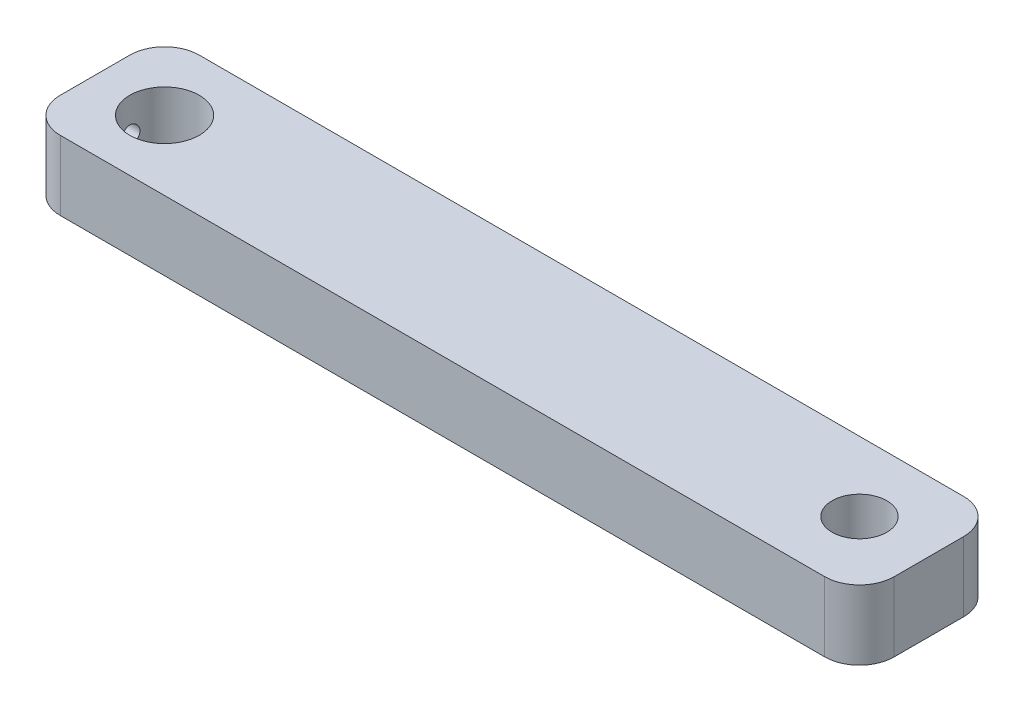
ISO-10303-21;
HEADER;
FILE_DESCRIPTION(('STEP AP214'),'2;1');
FILE_NAME('part.step','',(''),(''),'','','');
FILE_SCHEMA(('AUTOMOTIVE_DESIGN { 1 0 10303 214 1 1 1 1 }'));
ENDSEC;
DATA;
#1=APPLICATION_CONTEXT('core data for automotive mechanical design processes');
#2=APPLICATION_PROTOCOL_DEFINITION('international standard','automotive_design',2000,#1);
#3=PRODUCT_CONTEXT('',#1,'mechanical');
#4=PRODUCT('Part','Part','',(#3));
#5=PRODUCT_RELATED_PRODUCT_CATEGORY('part','',(#4));
#6=PRODUCT_DEFINITION_FORMATION('','',#4);
#7=PRODUCT_DEFINITION_CONTEXT('part definition',#1,'design');
#8=PRODUCT_DEFINITION('design','',#6,#7);
#9=PRODUCT_DEFINITION_SHAPE('','',#8);
#10=(LENGTH_UNIT() NAMED_UNIT(*) SI_UNIT(.MILLI.,.METRE.));
#11=(NAMED_UNIT(*) PLANE_ANGLE_UNIT() SI_UNIT($,.RADIAN.));
#12=(NAMED_UNIT(*) SI_UNIT($,.STERADIAN.) SOLID_ANGLE_UNIT());
#13=UNCERTAINTY_MEASURE_WITH_UNIT(LENGTH_MEASURE(1.E-05),#10,'distance_accuracy_value','');
#14=(GEOMETRIC_REPRESENTATION_CONTEXT(3) GLOBAL_UNCERTAINTY_ASSIGNED_CONTEXT((#13)) GLOBAL_UNIT_ASSIGNED_CONTEXT((#10,
#11,#12)) REPRESENTATION_CONTEXT('',''));
#15=CARTESIAN_POINT('',(0.,0.,0.));
#16=DIRECTION('',(0.,0.,1.));
#17=DIRECTION('',(1.,0.,0.));
#18=AXIS2_PLACEMENT_3D('',#15,#16,#17);
#19=CARTESIAN_POINT('',(0.,12.7,0.));
#20=DIRECTION('',(0.,1.,0.));
#21=DIRECTION('',(0.,0.,1.));
#22=AXIS2_PLACEMENT_3D('',#19,#20,#21);
#23=PLANE('',#22);
#24=CARTESIAN_POINT('',(0.,12.7,0.));
#25=DIRECTION('',(0.,1.,0.));
#26=DIRECTION('',(0.,0.,1.));
#27=AXIS2_PLACEMENT_3D('',#24,#25,#26);
#28=CIRCLE('',#27,6.35);
#29=CARTESIAN_POINT('',(0.,12.7,6.35));
#30=VERTEX_POINT('',#29);
#31=EDGE_CURVE('E214',#30,#30,#28,.T.);
#32=ORIENTED_EDGE('',*,*,#31,.F.);
#33=EDGE_LOOP('',(#32));
#34=FACE_BOUND('',#33,.T.);
#35=DIRECTION('',(1.,0.,0.));
#36=VECTOR('',#35,1.);
#37=CARTESIAN_POINT('',(-12.7,12.7,12.7));
#38=LINE('',#37,#36);
#39=CARTESIAN_POINT('',(-6.35,12.7,12.7));
#40=VERTEX_POINT('',#39);
#41=CARTESIAN_POINT('',(133.35,12.7,12.7));
#42=VERTEX_POINT('',#41);
#43=EDGE_CURVE('E225',#40,#42,#38,.T.);
#44=ORIENTED_EDGE('',*,*,#43,.T.);
#45=CARTESIAN_POINT('',(133.35,12.7,6.35));
#46=DIRECTION('',(0.,1.,0.));
#47=DIRECTION('',(0.,0.,1.));
#48=AXIS2_PLACEMENT_3D('',#45,#46,#47);
#49=CIRCLE('',#48,6.35);
#50=CARTESIAN_POINT('',(139.7,12.7,6.35));
#51=VERTEX_POINT('',#50);
#52=EDGE_CURVE('E193',#42,#51,#49,.T.);
#53=ORIENTED_EDGE('',*,*,#52,.T.);
#54=DIRECTION('',(0.,0.,-1.));
#55=VECTOR('',#54,1.);
#56=CARTESIAN_POINT('',(139.7,12.7,-12.7));
#57=LINE('',#56,#55);
#58=CARTESIAN_POINT('',(139.7,12.7,-6.35));
#59=VERTEX_POINT('',#58);
#60=EDGE_CURVE('E147',#51,#59,#57,.T.);
#61=ORIENTED_EDGE('',*,*,#60,.T.);
#62=CARTESIAN_POINT('',(133.35,12.7,-6.35));
#63=DIRECTION('',(0.,1.,0.));
#64=DIRECTION('',(0.,0.,1.));
#65=AXIS2_PLACEMENT_3D('',#62,#63,#64);
#66=CIRCLE('',#65,6.35);
#67=CARTESIAN_POINT('',(133.35,12.7,-12.7));
#68=VERTEX_POINT('',#67);
#69=EDGE_CURVE('E72',#59,#68,#66,.T.);
#70=ORIENTED_EDGE('',*,*,#69,.T.);
#71=DIRECTION('',(-1.,0.,0.));
#72=VECTOR('',#71,1.);
#73=CARTESIAN_POINT('',(-12.7,12.7,-12.7));
#74=LINE('',#73,#72);
#75=CARTESIAN_POINT('',(-6.35,12.7,-12.7));
#76=VERTEX_POINT('',#75);
#77=EDGE_CURVE('E171',#68,#76,#74,.T.);
#78=ORIENTED_EDGE('',*,*,#77,.T.);
#79=CARTESIAN_POINT('',(-6.35,12.7,-6.35));
#80=DIRECTION('',(0.,1.,0.));
#81=DIRECTION('',(0.,0.,1.));
#82=AXIS2_PLACEMENT_3D('',#79,#80,#81);
#83=CIRCLE('',#82,6.35);
#84=CARTESIAN_POINT('',(-12.7,12.7,-6.35));
#85=VERTEX_POINT('',#84);
#86=EDGE_CURVE('E185',#76,#85,#83,.T.);
#87=ORIENTED_EDGE('',*,*,#86,.T.);
#88=DIRECTION('',(0.,0.,1.));
#89=VECTOR('',#88,1.);
#90=CARTESIAN_POINT('',(-12.7,12.7,-12.7));
#91=LINE('',#90,#89);
#92=CARTESIAN_POINT('',(-12.7,12.7,6.35));
#93=VERTEX_POINT('',#92);
#94=EDGE_CURVE('E163',#85,#93,#91,.T.);
#95=ORIENTED_EDGE('',*,*,#94,.T.);
#96=CARTESIAN_POINT('',(-6.35,12.7,6.35));
#97=DIRECTION('',(0.,1.,0.));
#98=DIRECTION('',(0.,0.,1.));
#99=AXIS2_PLACEMENT_3D('',#96,#97,#98);
#100=CIRCLE('',#99,6.35);
#101=EDGE_CURVE('E188',#93,#40,#100,.T.);
#102=ORIENTED_EDGE('',*,*,#101,.T.);
#103=EDGE_LOOP('',(#44,#53,#61,#70,#78,#87,#95,#102));
#104=FACE_BOUND('',#103,.T.);
#105=CARTESIAN_POINT('',(127.,12.7,0.));
#106=DIRECTION('',(0.,1.,0.));
#107=DIRECTION('',(0.,0.,1.));
#108=AXIS2_PLACEMENT_3D('',#105,#106,#107);
#109=CIRCLE('',#108,4.99999999999999);
#110=CARTESIAN_POINT('',(127.,12.7,4.99999999999999));
#111=VERTEX_POINT('',#110);
#112=EDGE_CURVE('E232',#111,#111,#109,.T.);
#113=ORIENTED_EDGE('',*,*,#112,.F.);
#114=EDGE_LOOP('',(#113));
#115=FACE_BOUND('',#114,.T.);
#116=ADVANCED_FACE('F44',(#34,#104,#115),#23,.T.);
#117=CARTESIAN_POINT('',(0.,0.,0.));
#118=DIRECTION('',(0.,1.,0.));
#119=DIRECTION('',(0.,0.,1.));
#120=AXIS2_PLACEMENT_3D('',#117,#118,#119);
#121=PLANE('',#120);
#122=DIRECTION('',(0.,0.,-1.));
#123=VECTOR('',#122,1.);
#124=CARTESIAN_POINT('',(139.7,0.,-12.7));
#125=LINE('',#124,#123);
#126=CARTESIAN_POINT('',(139.7,0.,6.35));
#127=VERTEX_POINT('',#126);
#128=CARTESIAN_POINT('',(139.7,0.,-6.35));
#129=VERTEX_POINT('',#128);
#130=EDGE_CURVE('E145',#127,#129,#125,.T.);
#131=ORIENTED_EDGE('',*,*,#130,.F.);
#132=CARTESIAN_POINT('',(133.35,0.,6.35));
#133=DIRECTION('',(0.,1.,0.));
#134=DIRECTION('',(0.,0.,1.));
#135=AXIS2_PLACEMENT_3D('',#132,#133,#134);
#136=CIRCLE('',#135,6.35);
#137=CARTESIAN_POINT('',(133.35,0.,12.7));
#138=VERTEX_POINT('',#137);
#139=EDGE_CURVE('E127',#127,#138,#136,.F.);
#140=ORIENTED_EDGE('',*,*,#139,.T.);
#141=DIRECTION('',(1.,0.,0.));
#142=VECTOR('',#141,1.);
#143=CARTESIAN_POINT('',(-12.7,0.,12.7));
#144=LINE('',#143,#142);
#145=CARTESIAN_POINT('',(-6.35,0.,12.7));
#146=VERTEX_POINT('',#145);
#147=EDGE_CURVE('E157',#146,#138,#144,.T.);
#148=ORIENTED_EDGE('',*,*,#147,.F.);
#149=CARTESIAN_POINT('',(-6.35,0.,6.35));
#150=DIRECTION('',(0.,1.,0.));
#151=DIRECTION('',(0.,0.,1.));
#152=AXIS2_PLACEMENT_3D('',#149,#150,#151);
#153=CIRCLE('',#152,6.35);
#154=CARTESIAN_POINT('',(-12.7,0.,6.35));
#155=VERTEX_POINT('',#154);
#156=EDGE_CURVE('E175',#146,#155,#153,.F.);
#157=ORIENTED_EDGE('',*,*,#156,.T.);
#158=DIRECTION('',(0.,0.,1.));
#159=VECTOR('',#158,1.);
#160=CARTESIAN_POINT('',(-12.7,0.,-12.7));
#161=LINE('',#160,#159);
#162=CARTESIAN_POINT('',(-12.7,0.,-6.35));
#163=VERTEX_POINT('',#162);
#164=EDGE_CURVE('E166',#163,#155,#161,.T.);
#165=ORIENTED_EDGE('',*,*,#164,.F.);
#166=CARTESIAN_POINT('',(-6.35,0.,-6.35));
#167=DIRECTION('',(0.,1.,0.));
#168=DIRECTION('',(0.,0.,1.));
#169=AXIS2_PLACEMENT_3D('',#166,#167,#168);
#170=CIRCLE('',#169,6.35);
#171=CARTESIAN_POINT('',(-6.35,0.,-12.7));
#172=VERTEX_POINT('',#171);
#173=EDGE_CURVE('E149',#163,#172,#170,.F.);
#174=ORIENTED_EDGE('',*,*,#173,.T.);
#175=DIRECTION('',(-1.,0.,0.));
#176=VECTOR('',#175,1.);
#177=CARTESIAN_POINT('',(-12.7,0.,-12.7));
#178=LINE('',#177,#176);
#179=CARTESIAN_POINT('',(133.35,0.,-12.7));
#180=VERTEX_POINT('',#179);
#181=EDGE_CURVE('E156',#180,#172,#178,.T.);
#182=ORIENTED_EDGE('',*,*,#181,.F.);
#183=CARTESIAN_POINT('',(133.35,0.,-6.35));
#184=DIRECTION('',(0.,1.,0.));
#185=DIRECTION('',(0.,0.,1.));
#186=AXIS2_PLACEMENT_3D('',#183,#184,#185);
#187=CIRCLE('',#186,6.35);
#188=EDGE_CURVE('E139',#180,#129,#187,.F.);
#189=ORIENTED_EDGE('',*,*,#188,.T.);
#190=EDGE_LOOP('',(#131,#140,#148,#157,#165,#174,#182,#189));
#191=FACE_BOUND('',#190,.T.);
#192=CARTESIAN_POINT('',(0.,0.,0.));
#193=DIRECTION('',(0.,1.,0.));
#194=DIRECTION('',(0.,0.,1.));
#195=AXIS2_PLACEMENT_3D('',#192,#193,#194);
#196=CIRCLE('',#195,6.35);
#197=CARTESIAN_POINT('',(0.,0.,6.35));
#198=VERTEX_POINT('',#197);
#199=EDGE_CURVE('E218',#198,#198,#196,.T.);
#200=ORIENTED_EDGE('',*,*,#199,.T.);
#201=EDGE_LOOP('',(#200));
#202=FACE_BOUND('',#201,.T.);
#203=CARTESIAN_POINT('',(127.,0.,0.));
#204=DIRECTION('',(0.,1.,0.));
#205=DIRECTION('',(0.,0.,1.));
#206=AXIS2_PLACEMENT_3D('',#203,#204,#205);
#207=CIRCLE('',#206,4.99999999999999);
#208=CARTESIAN_POINT('',(127.,0.,4.99999999999999));
#209=VERTEX_POINT('',#208);
#210=EDGE_CURVE('E234',#209,#209,#207,.T.);
#211=ORIENTED_EDGE('',*,*,#210,.T.);
#212=EDGE_LOOP('',(#211));
#213=FACE_BOUND('',#212,.T.);
#214=ADVANCED_FACE('F152',(#191,#202,#213),#121,.F.);
#215=CARTESIAN_POINT('',(-12.7,12.7,-12.7));
#216=DIRECTION('',(1.,0.,0.));
#217=DIRECTION('',(0.,0.,-1.));
#218=AXIS2_PLACEMENT_3D('',#215,#216,#217);
#219=PLANE('',#218);
#220=CARTESIAN_POINT('',(-12.7,6.35,0.));
#221=DIRECTION('',(-1.,0.,0.));
#222=DIRECTION('',(0.,0.,1.));
#223=AXIS2_PLACEMENT_3D('',#220,#221,#222);
#224=CIRCLE('',#223,1.64999999999999);
#225=CARTESIAN_POINT('',(-12.7,6.35,1.64999999999999));
#226=VERTEX_POINT('',#225);
#227=EDGE_CURVE('E249',#226,#226,#224,.T.);
#228=ORIENTED_EDGE('',*,*,#227,.F.);
#229=EDGE_LOOP('',(#228));
#230=FACE_BOUND('',#229,.T.);
#231=ORIENTED_EDGE('',*,*,#164,.T.);
#232=DIRECTION('',(0.,-1.,0.));
#233=VECTOR('',#232,1.);
#234=CARTESIAN_POINT('',(-12.7,12.7,6.35));
#235=LINE('',#234,#233);
#236=EDGE_CURVE('E11',#155,#93,#235,.F.);
#237=ORIENTED_EDGE('',*,*,#236,.T.);
#238=ORIENTED_EDGE('',*,*,#94,.F.);
#239=DIRECTION('',(0.,-1.,0.));
#240=VECTOR('',#239,1.);
#241=CARTESIAN_POINT('',(-12.7,12.7,-6.35));
#242=LINE('',#241,#240);
#243=EDGE_CURVE('E53',#85,#163,#242,.T.);
#244=ORIENTED_EDGE('',*,*,#243,.T.);
#245=EDGE_LOOP('',(#231,#237,#238,#244));
#246=FACE_BOUND('',#245,.T.);
#247=ADVANCED_FACE('F208',(#230,#246),#219,.F.);
#248=CARTESIAN_POINT('',(-12.7,12.7,12.7));
#249=DIRECTION('',(0.,0.,-1.));
#250=DIRECTION('',(-1.,0.,0.));
#251=AXIS2_PLACEMENT_3D('',#248,#249,#250);
#252=PLANE('',#251);
#253=ORIENTED_EDGE('',*,*,#147,.T.);
#254=DIRECTION('',(0.,-1.,0.));
#255=VECTOR('',#254,1.);
#256=CARTESIAN_POINT('',(133.35,12.7,12.7));
#257=LINE('',#256,#255);
#258=EDGE_CURVE('E132',#138,#42,#257,.F.);
#259=ORIENTED_EDGE('',*,*,#258,.T.);
#260=ORIENTED_EDGE('',*,*,#43,.F.);
#261=DIRECTION('',(0.,-1.,0.));
#262=VECTOR('',#261,1.);
#263=CARTESIAN_POINT('',(-6.35,12.7,12.7));
#264=LINE('',#263,#262);
#265=EDGE_CURVE('E138',#40,#146,#264,.T.);
#266=ORIENTED_EDGE('',*,*,#265,.T.);
#267=EDGE_LOOP('',(#253,#259,#260,#266));
#268=FACE_BOUND('',#267,.T.);
#269=ADVANCED_FACE('F278',(#268),#252,.F.);
#270=CARTESIAN_POINT('',(139.7,12.7,-12.7));
#271=DIRECTION('',(-1.,0.,0.));
#272=DIRECTION('',(0.,0.,1.));
#273=AXIS2_PLACEMENT_3D('',#270,#271,#272);
#274=PLANE('',#273);
#275=ORIENTED_EDGE('',*,*,#60,.F.);
#276=DIRECTION('',(0.,-1.,0.));
#277=VECTOR('',#276,1.);
#278=CARTESIAN_POINT('',(139.7,12.7,6.35));
#279=LINE('',#278,#277);
#280=EDGE_CURVE('E131',#51,#127,#279,.T.);
#281=ORIENTED_EDGE('',*,*,#280,.T.);
#282=ORIENTED_EDGE('',*,*,#130,.T.);
#283=DIRECTION('',(0.,-1.,0.));
#284=VECTOR('',#283,1.);
#285=CARTESIAN_POINT('',(139.7,12.7,-6.35));
#286=LINE('',#285,#284);
#287=EDGE_CURVE('E150',#129,#59,#286,.F.);
#288=ORIENTED_EDGE('',*,*,#287,.T.);
#289=EDGE_LOOP('',(#275,#281,#282,#288));
#290=FACE_BOUND('',#289,.T.);
#291=ADVANCED_FACE('F144',(#290),#274,.F.);
#292=CARTESIAN_POINT('',(-12.7,12.7,-12.7));
#293=DIRECTION('',(0.,0.,1.));
#294=DIRECTION('',(1.,0.,0.));
#295=AXIS2_PLACEMENT_3D('',#292,#293,#294);
#296=PLANE('',#295);
#297=ORIENTED_EDGE('',*,*,#77,.F.);
#298=DIRECTION('',(0.,-1.,0.));
#299=VECTOR('',#298,1.);
#300=CARTESIAN_POINT('',(133.35,12.7,-12.7));
#301=LINE('',#300,#299);
#302=EDGE_CURVE('E198',#68,#180,#301,.T.);
#303=ORIENTED_EDGE('',*,*,#302,.T.);
#304=ORIENTED_EDGE('',*,*,#181,.T.);
#305=DIRECTION('',(0.,-1.,0.));
#306=VECTOR('',#305,1.);
#307=CARTESIAN_POINT('',(-6.35,12.7,-12.7));
#308=LINE('',#307,#306);
#309=EDGE_CURVE('E62',#172,#76,#308,.F.);
#310=ORIENTED_EDGE('',*,*,#309,.T.);
#311=EDGE_LOOP('',(#297,#303,#304,#310));
#312=FACE_BOUND('',#311,.T.);
#313=ADVANCED_FACE('F273',(#312),#296,.F.);
#314=CARTESIAN_POINT('',(0.,12.7,0.));
#315=DIRECTION('',(0.,-1.,0.));
#316=DIRECTION('',(0.,0.,-1.));
#317=AXIS2_PLACEMENT_3D('',#314,#315,#316);
#318=CYLINDRICAL_SURFACE('',#317,6.35);
#319=CARTESIAN_POINT('',(-6.13188388670236,6.35,1.64999999999999));
#320=CARTESIAN_POINT('',(-6.13188553974097,6.25901367217286,1.64999763632435));
#321=CARTESIAN_POINT('',(-6.1339311300214,6.16800186743923,1.64244844153518));
#322=CARTESIAN_POINT('',(-6.14186949481345,5.98860049001511,1.61250455514408));
#323=CARTESIAN_POINT('',(-6.14776432732408,5.90021234650977,1.59010192204639));
#324=CARTESIAN_POINT('',(-6.16268948392982,5.72867933385445,1.53123224488277));
#325=CARTESIAN_POINT('',(-6.17171554866364,5.6455275224345,1.49478429898852));
#326=CARTESIAN_POINT('',(-6.19188078325927,5.48650747193363,1.40891777621457));
#327=CARTESIAN_POINT('',(-6.20302008656419,5.41063969326799,1.35949838016072));
#328=CARTESIAN_POINT('',(-6.2264531082588,5.26653888418004,1.24783688885235));
#329=CARTESIAN_POINT('',(-6.23876646120304,5.19850448698938,1.18534252309151));
#330=CARTESIAN_POINT('',(-6.26299035325661,5.07375511337511,1.04984797263573));
#331=CARTESIAN_POINT('',(-6.27490085225206,5.01704126144658,0.97684674550903));
#332=CARTESIAN_POINT('',(-6.29719537033068,4.91572109001749,0.821040256319276));
#333=CARTESIAN_POINT('',(-6.30755352225317,4.8713112699395,0.738103189338835));
#334=CARTESIAN_POINT('',(-6.3253515123212,4.79713968574369,0.565626227797404));
#335=CARTESIAN_POINT('',(-6.33279181676967,4.76737558089163,0.476087390988518));
#336=CARTESIAN_POINT('',(-6.34377696958343,4.72398042216759,0.295020848099689));
#337=CARTESIAN_POINT('',(-6.34740322613677,4.7100117165979,0.203579090054251));
#338=CARTESIAN_POINT('',(-6.35063594138407,4.69754258164854,0.0195829629697852));
#339=CARTESIAN_POINT('',(-6.35024304016357,4.69903968920516,-0.0729712265599146));
#340=CARTESIAN_POINT('',(-6.34554175382561,4.7172197932799,-0.25421825018417));
#341=CARTESIAN_POINT('',(-6.34132739539431,4.73353813020786,-0.342950470718934));
#342=CARTESIAN_POINT('',(-6.32956706077998,4.78030959498934,-0.516371169852858));
#343=CARTESIAN_POINT('',(-6.32202089963765,4.81076350755989,-0.601059423668875));
#344=CARTESIAN_POINT('',(-6.30430356599421,4.88522758322252,-0.764931511252373));
#345=CARTESIAN_POINT('',(-6.29410796246699,4.9293646946024,-0.844054909308998));
#346=CARTESIAN_POINT('',(-6.27219339176724,5.029845323999,-0.993897831944067));
#347=CARTESIAN_POINT('',(-6.26047414095694,5.08619111605335,-1.0646157870859));
#348=CARTESIAN_POINT('',(-6.23638166643451,5.21143344908247,-1.1978163351087));
#349=CARTESIAN_POINT('',(-6.22399933862566,5.280648309973,-1.25999831770284));
#350=CARTESIAN_POINT('',(-6.20028671836818,5.42865230967851,-1.37194316665815));
#351=CARTESIAN_POINT('',(-6.1889564835787,5.50744197268751,-1.42170535261384));
#352=CARTESIAN_POINT('',(-6.16859596556769,5.67298485980603,-1.50761156967559));
#353=CARTESIAN_POINT('',(-6.15957891257177,5.75978019495149,-1.54367780672265));
#354=CARTESIAN_POINT('',(-6.14503216732012,5.93849438997561,-1.60061006098444));
#355=CARTESIAN_POINT('',(-6.139501660199,6.03041204720999,-1.62147963009722));
#356=CARTESIAN_POINT('',(-6.13272673240101,6.21396009511478,-1.64691605317233));
#357=CARTESIAN_POINT('',(-6.13136488687884,6.30552430730878,-1.65192968322157));
#358=CARTESIAN_POINT('',(-6.13276088410879,6.4881820664328,-1.64673961148689));
#359=CARTESIAN_POINT('',(-6.13551831339115,6.57927565968,-1.63653743698052));
#360=CARTESIAN_POINT('',(-6.14472911696836,6.75671110323316,-1.60159835751182));
#361=CARTESIAN_POINT('',(-6.15111504469164,6.84310898073015,-1.57712648589761));
#362=CARTESIAN_POINT('',(-6.16679819321596,7.01057491392088,-1.51463894373683));
#363=CARTESIAN_POINT('',(-6.17609577975076,7.09164229850218,-1.47662157165585));
#364=CARTESIAN_POINT('',(-6.19679824352577,7.24802518496908,-1.38720350487008));
#365=CARTESIAN_POINT('',(-6.20824328210405,7.32318410142839,-1.33553846790758));
#366=CARTESIAN_POINT('',(-6.23185492577481,7.46392955710172,-1.22062204687912));
#367=CARTESIAN_POINT('',(-6.24402165913229,7.52951438752571,-1.15736859903677));
#368=CARTESIAN_POINT('',(-6.26810744462942,7.65108587791925,-1.01901104089209));
#369=CARTESIAN_POINT('',(-6.28001069362144,7.70676200818837,-0.943630791915345));
#370=CARTESIAN_POINT('',(-6.3018866129425,7.80466820263947,-0.784333377232091));
#371=CARTESIAN_POINT('',(-6.31185938554421,7.84689897920513,-0.700416664129444));
#372=CARTESIAN_POINT('',(-6.3286868090298,7.91633592507454,-0.527016611327758));
#373=CARTESIAN_POINT('',(-6.33556437657373,7.94365284808586,-0.437579952621994));
#374=CARTESIAN_POINT('',(-6.34552712562432,7.98281297131538,-0.255181418968193));
#375=CARTESIAN_POINT('',(-6.34861310203662,7.99465941494647,-0.162220287138927));
#376=CARTESIAN_POINT('',(-6.35060954213632,8.00234769751966,0.0216806405939055));
#377=CARTESIAN_POINT('',(-6.34963914291606,7.99864616976501,0.112600330589237));
#378=CARTESIAN_POINT('',(-6.34389911049899,7.97639785905599,0.292475723160709));
#379=CARTESIAN_POINT('',(-6.33912960729081,7.9578515840235,0.381431492826546));
#380=CARTESIAN_POINT('',(-6.32634877587924,7.90669305365337,0.55433424960566));
#381=CARTESIAN_POINT('',(-6.31835785750941,7.8741692711005,0.63830902204967));
#382=CARTESIAN_POINT('',(-6.29997214989296,7.79605835867291,0.799657538098563));
#383=CARTESIAN_POINT('',(-6.2895770371773,7.75046947077401,0.877030391538027));
#384=CARTESIAN_POINT('',(-6.26716709585033,7.64616260734548,1.02512119470899));
#385=CARTESIAN_POINT('',(-6.25511766534272,7.58713890338259,1.09561856239326));
#386=CARTESIAN_POINT('',(-6.23090349817101,7.45822343357038,1.22586275551582));
#387=CARTESIAN_POINT('',(-6.21873873245658,7.38832885741608,1.28560679239571));
#388=CARTESIAN_POINT('',(-6.19538429010402,7.23792459686433,1.39386165712694));
#389=CARTESIAN_POINT('',(-6.18421983395787,7.1572260515196,1.44211599306215));
#390=CARTESIAN_POINT('',(-6.16447892641519,6.98858204888244,1.52430254643321));
#391=CARTESIAN_POINT('',(-6.15590070313312,6.90064160600505,1.55824457593225));
#392=CARTESIAN_POINT('',(-6.14355741275248,6.73579377723138,1.60614388011357));
#393=CARTESIAN_POINT('',(-6.13921421063347,6.65963298690867,1.62255248361922));
#394=CARTESIAN_POINT('',(-6.13337688486827,6.5056542335596,1.64448100300522));
#395=CARTESIAN_POINT('',(-6.13188247257078,6.42783643923581,1.65000202206309));
#396=CARTESIAN_POINT('',(-6.13188388670236,6.35,1.64999999999999));
#397=B_SPLINE_CURVE_WITH_KNOTS('',3,(#319,#320,#321,#322,#323,#324,#325,#326,#327,#328,#329,
#330,#331,#332,#333,#334,#335,#336,#337,#338,#339,#340,#341,#342,#343,#344,#345,#346,#347,#348,
#349,#350,#351,#352,#353,#354,#355,#356,#357,#358,#359,#360,#361,#362,#363,#364,#365,#366,#367,
#368,#369,#370,#371,#372,#373,#374,#375,#376,#377,#378,#379,#380,#381,#382,#383,#384,#385,#386,
#387,#388,#389,#390,#391,#392,#393,#394,#395,#396),.UNSPECIFIED.,.T.,.F.,(4,2,2,2,2,2,2,2,2,2,2,
2,2,2,2,2,2,2,2,2,2,2,2,2,2,2,2,2,2,2,2,2,2,2,2,2,2,2,4),(0.,0.272672926683556,
0.545491757562702,0.817940923503112,1.09040729931828,1.36871710122713,1.64705453452927,
1.92960985094953,2.21211999361815,2.48846958169581,2.76477515940421,3.03446142923301,
3.30416267211511,3.57644504089438,3.84877816974042,4.12905991840251,4.40935701863624,
4.69122322600103,4.97302353196756,5.24680930902984,5.52056760685323,5.78939636875259,
6.05825891181396,6.33276889460922,6.6073278124053,6.88937426953429,7.17140578032907,
7.45131334025018,7.73116220763907,8.0028504604254,8.27452941763359,8.54451349870578,
8.81453392556815,9.09145439408533,9.36844657060041,9.65113942210738,9.93363815202065,
10.1669263945671,10.4001909981169),.UNSPECIFIED.);
#398=CARTESIAN_POINT('',(-6.13188388670236,6.35,1.64999999999999));
#399=VERTEX_POINT('',#398);
#400=EDGE_CURVE('E238',#399,#399,#397,.T.);
#401=ORIENTED_EDGE('',*,*,#400,.F.);
#402=EDGE_LOOP('',(#401));
#403=FACE_BOUND('',#402,.T.);
#404=ORIENTED_EDGE('',*,*,#31,.T.);
#405=EDGE_LOOP('',(#404));
#406=FACE_BOUND('',#405,.T.);
#407=ORIENTED_EDGE('',*,*,#199,.F.);
#408=EDGE_LOOP('',(#407));
#409=FACE_BOUND('',#408,.T.);
#410=ADVANCED_FACE('F271',(#403,#406,#409),#318,.F.);
#411=CARTESIAN_POINT('',(127.,12.7,0.));
#412=DIRECTION('',(0.,-1.,0.));
#413=DIRECTION('',(0.,0.,-1.));
#414=AXIS2_PLACEMENT_3D('',#411,#412,#413);
#415=CYLINDRICAL_SURFACE('',#414,4.99999999999999);
#416=ORIENTED_EDGE('',*,*,#112,.T.);
#417=EDGE_LOOP('',(#416));
#418=FACE_BOUND('',#417,.T.);
#419=ORIENTED_EDGE('',*,*,#210,.F.);
#420=EDGE_LOOP('',(#419));
#421=FACE_BOUND('',#420,.T.);
#422=ADVANCED_FACE('F288',(#418,#421),#415,.F.);
#423=CARTESIAN_POINT('',(133.35,12.7,6.35));
#424=DIRECTION('',(0.,-1.,0.));
#425=DIRECTION('',(0.,0.,-1.));
#426=AXIS2_PLACEMENT_3D('',#423,#424,#425);
#427=CYLINDRICAL_SURFACE('',#426,6.35);
#428=ORIENTED_EDGE('',*,*,#52,.F.);
#429=ORIENTED_EDGE('',*,*,#258,.F.);
#430=ORIENTED_EDGE('',*,*,#139,.F.);
#431=ORIENTED_EDGE('',*,*,#280,.F.);
#432=EDGE_LOOP('',(#428,#429,#430,#431));
#433=FACE_BOUND('',#432,.T.);
#434=ADVANCED_FACE('F130',(#433),#427,.T.);
#435=CARTESIAN_POINT('',(133.35,12.7,-6.35));
#436=DIRECTION('',(0.,-1.,0.));
#437=DIRECTION('',(0.,0.,-1.));
#438=AXIS2_PLACEMENT_3D('',#435,#436,#437);
#439=CYLINDRICAL_SURFACE('',#438,6.35);
#440=ORIENTED_EDGE('',*,*,#69,.F.);
#441=ORIENTED_EDGE('',*,*,#287,.F.);
#442=ORIENTED_EDGE('',*,*,#188,.F.);
#443=ORIENTED_EDGE('',*,*,#302,.F.);
#444=EDGE_LOOP('',(#440,#441,#442,#443));
#445=FACE_BOUND('',#444,.T.);
#446=ADVANCED_FACE('F287',(#445),#439,.T.);
#447=CARTESIAN_POINT('',(-6.35,12.7,6.35));
#448=DIRECTION('',(0.,-1.,0.));
#449=DIRECTION('',(0.,0.,-1.));
#450=AXIS2_PLACEMENT_3D('',#447,#448,#449);
#451=CYLINDRICAL_SURFACE('',#450,6.35);
#452=ORIENTED_EDGE('',*,*,#101,.F.);
#453=ORIENTED_EDGE('',*,*,#236,.F.);
#454=ORIENTED_EDGE('',*,*,#156,.F.);
#455=ORIENTED_EDGE('',*,*,#265,.F.);
#456=EDGE_LOOP('',(#452,#453,#454,#455));
#457=FACE_BOUND('',#456,.T.);
#458=ADVANCED_FACE('F259',(#457),#451,.T.);
#459=CARTESIAN_POINT('',(-6.35,12.7,-6.35));
#460=DIRECTION('',(0.,-1.,0.));
#461=DIRECTION('',(0.,0.,-1.));
#462=AXIS2_PLACEMENT_3D('',#459,#460,#461);
#463=CYLINDRICAL_SURFACE('',#462,6.35);
#464=ORIENTED_EDGE('',*,*,#86,.F.);
#465=ORIENTED_EDGE('',*,*,#309,.F.);
#466=ORIENTED_EDGE('',*,*,#173,.F.);
#467=ORIENTED_EDGE('',*,*,#243,.F.);
#468=EDGE_LOOP('',(#464,#465,#466,#467));
#469=FACE_BOUND('',#468,.T.);
#470=ADVANCED_FACE('F46',(#469),#463,.T.);
#471=CARTESIAN_POINT('',(-12.7,6.35,0.));
#472=DIRECTION('',(-1.,0.,0.));
#473=DIRECTION('',(0.,0.,1.));
#474=AXIS2_PLACEMENT_3D('',#471,#472,#473);
#475=CYLINDRICAL_SURFACE('',#474,1.64999999999999);
#476=ORIENTED_EDGE('',*,*,#227,.T.);
#477=EDGE_LOOP('',(#476));
#478=FACE_BOUND('',#477,.T.);
#479=ORIENTED_EDGE('',*,*,#400,.T.);
#480=EDGE_LOOP('',(#479));
#481=FACE_BOUND('',#480,.T.);
#482=ADVANCED_FACE('F252',(#478,#481),#475,.F.);
#483=CLOSED_SHELL('',(#116,#214,#247,#269,#291,#313,#410,#422,#434,#446,#458,#470,#482));
#484=MANIFOLD_SOLID_BREP('B2',#483);
#485=ADVANCED_BREP_SHAPE_REPRESENTATION('',(#18,#484),#14);
#486=SHAPE_DEFINITION_REPRESENTATION(#9,#485);
ENDSEC;
END-ISO-10303-21;
